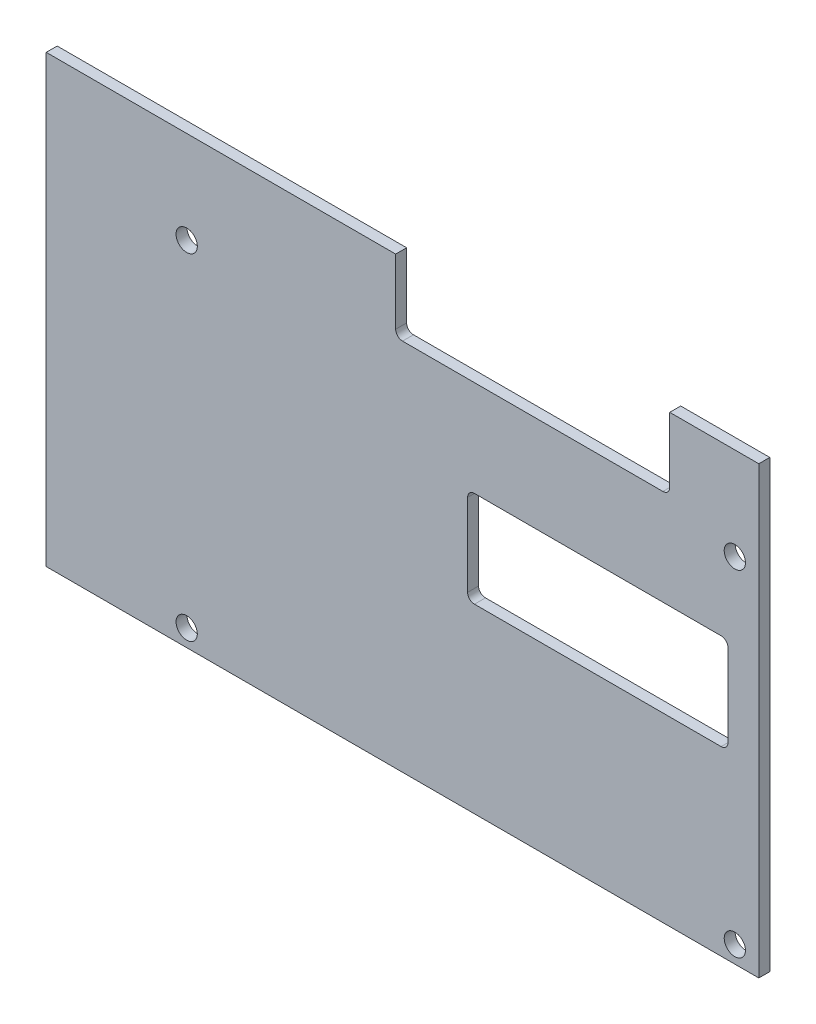
ISO-10303-21;
HEADER;
FILE_DESCRIPTION(('STEP AP214'),'2;1');
FILE_NAME('part.step','',(''),(''),'','','');
FILE_SCHEMA(('AUTOMOTIVE_DESIGN { 1 0 10303 214 1 1 1 1 }'));
ENDSEC;
DATA;
#1=APPLICATION_CONTEXT('core data for automotive mechanical design processes');
#2=APPLICATION_PROTOCOL_DEFINITION('international standard','automotive_design',2000,#1);
#3=PRODUCT_CONTEXT('',#1,'mechanical');
#4=PRODUCT('Part','Part','',(#3));
#5=PRODUCT_RELATED_PRODUCT_CATEGORY('part','',(#4));
#6=PRODUCT_DEFINITION_FORMATION('','',#4);
#7=PRODUCT_DEFINITION_CONTEXT('part definition',#1,'design');
#8=PRODUCT_DEFINITION('design','',#6,#7);
#9=PRODUCT_DEFINITION_SHAPE('','',#8);
#10=(LENGTH_UNIT() NAMED_UNIT(*) SI_UNIT(.MILLI.,.METRE.));
#11=(NAMED_UNIT(*) PLANE_ANGLE_UNIT() SI_UNIT($,.RADIAN.));
#12=(NAMED_UNIT(*) SI_UNIT($,.STERADIAN.) SOLID_ANGLE_UNIT());
#13=UNCERTAINTY_MEASURE_WITH_UNIT(LENGTH_MEASURE(1.E-05),#10,'distance_accuracy_value','');
#14=(GEOMETRIC_REPRESENTATION_CONTEXT(3) GLOBAL_UNCERTAINTY_ASSIGNED_CONTEXT((#13)) GLOBAL_UNIT_ASSIGNED_CONTEXT((#10,
#11,#12)) REPRESENTATION_CONTEXT('',''));
#15=CARTESIAN_POINT('',(0.,0.,0.));
#16=DIRECTION('',(0.,0.,1.));
#17=DIRECTION('',(1.,0.,0.));
#18=AXIS2_PLACEMENT_3D('',#15,#16,#17);
#19=CARTESIAN_POINT('',(52.,55.5,1.6));
#20=DIRECTION('',(0.,0.,-1.));
#21=DIRECTION('',(-1.,0.,0.));
#22=AXIS2_PLACEMENT_3D('',#19,#20,#21);
#23=PLANE('',#22);
#24=CARTESIAN_POINT('',(20.5,2.5,1.6));
#25=DIRECTION('',(0.,0.,1.));
#26=DIRECTION('',(1.,0.,0.));
#27=AXIS2_PLACEMENT_3D('',#24,#25,#26);
#28=CIRCLE('',#27,1.55);
#29=CARTESIAN_POINT('',(22.05,2.5,1.6));
#30=VERTEX_POINT('',#29);
#31=EDGE_CURVE('E221',#30,#30,#28,.T.);
#32=ORIENTED_EDGE('',*,*,#31,.F.);
#33=EDGE_LOOP('',(#32));
#34=FACE_BOUND('',#33,.T.);
#35=CARTESIAN_POINT('',(100.5,51.5,1.6));
#36=DIRECTION('',(0.,0.,1.));
#37=DIRECTION('',(1.,0.,0.));
#38=AXIS2_PLACEMENT_3D('',#35,#36,#37);
#39=CIRCLE('',#38,1.54999999999999);
#40=CARTESIAN_POINT('',(102.05,51.5,1.6));
#41=VERTEX_POINT('',#40);
#42=EDGE_CURVE('E233',#41,#41,#39,.T.);
#43=ORIENTED_EDGE('',*,*,#42,.F.);
#44=EDGE_LOOP('',(#43));
#45=FACE_BOUND('',#44,.T.);
#46=DIRECTION('',(0.,-1.,0.));
#47=VECTOR('',#46,1.);
#48=CARTESIAN_POINT('',(0.,0.,1.6));
#49=LINE('',#48,#47);
#50=CARTESIAN_POINT('',(0.,65.,1.6));
#51=VERTEX_POINT('',#50);
#52=CARTESIAN_POINT('',(0.,0.,1.6));
#53=VERTEX_POINT('',#52);
#54=EDGE_CURVE('E245',#51,#53,#49,.T.);
#55=ORIENTED_EDGE('',*,*,#54,.T.);
#56=DIRECTION('',(1.,0.,0.));
#57=VECTOR('',#56,1.);
#58=CARTESIAN_POINT('',(0.,0.,1.6));
#59=LINE('',#58,#57);
#60=CARTESIAN_POINT('',(104.,0.,1.6));
#61=VERTEX_POINT('',#60);
#62=EDGE_CURVE('E248',#53,#61,#59,.T.);
#63=ORIENTED_EDGE('',*,*,#62,.T.);
#64=DIRECTION('',(0.,1.,0.));
#65=VECTOR('',#64,1.);
#66=CARTESIAN_POINT('',(104.,0.,1.6));
#67=LINE('',#66,#65);
#68=CARTESIAN_POINT('',(104.,65.,1.6));
#69=VERTEX_POINT('',#68);
#70=EDGE_CURVE('E251',#61,#69,#67,.T.);
#71=ORIENTED_EDGE('',*,*,#70,.T.);
#72=DIRECTION('',(-1.,0.,0.));
#73=VECTOR('',#72,1.);
#74=CARTESIAN_POINT('',(91.,65.,1.6));
#75=LINE('',#74,#73);
#76=CARTESIAN_POINT('',(91.,65.,1.6));
#77=VERTEX_POINT('',#76);
#78=EDGE_CURVE('E253',#69,#77,#75,.T.);
#79=ORIENTED_EDGE('',*,*,#78,.T.);
#80=DIRECTION('',(0.,-1.,0.));
#81=VECTOR('',#80,1.);
#82=CARTESIAN_POINT('',(91.,55.5,1.6));
#83=LINE('',#82,#81);
#84=CARTESIAN_POINT('',(91.,55.5,1.6));
#85=VERTEX_POINT('',#84);
#86=EDGE_CURVE('E255',#77,#85,#83,.T.);
#87=ORIENTED_EDGE('',*,*,#86,.T.);
#88=CARTESIAN_POINT('',(90.,55.5,1.6));
#89=DIRECTION('',(0.,0.,-1.));
#90=DIRECTION('',(-1.,0.,0.));
#91=AXIS2_PLACEMENT_3D('',#88,#89,#90);
#92=CIRCLE('',#91,0.99999999999999);
#93=CARTESIAN_POINT('',(90.,54.5,1.6));
#94=VERTEX_POINT('',#93);
#95=EDGE_CURVE('E257',#85,#94,#92,.T.);
#96=ORIENTED_EDGE('',*,*,#95,.T.);
#97=DIRECTION('',(-1.,0.,0.));
#98=VECTOR('',#97,1.);
#99=CARTESIAN_POINT('',(52.,54.5,1.6));
#100=LINE('',#99,#98);
#101=CARTESIAN_POINT('',(52.,54.5,1.6));
#102=VERTEX_POINT('',#101);
#103=EDGE_CURVE('E259',#94,#102,#100,.T.);
#104=ORIENTED_EDGE('',*,*,#103,.T.);
#105=CARTESIAN_POINT('',(52.,55.5,1.6));
#106=DIRECTION('',(0.,0.,-1.));
#107=DIRECTION('',(-1.,0.,0.));
#108=AXIS2_PLACEMENT_3D('',#105,#106,#107);
#109=CIRCLE('',#108,1.);
#110=CARTESIAN_POINT('',(51.,55.5,1.6));
#111=VERTEX_POINT('',#110);
#112=EDGE_CURVE('E261',#102,#111,#109,.T.);
#113=ORIENTED_EDGE('',*,*,#112,.T.);
#114=DIRECTION('',(0.,1.,0.));
#115=VECTOR('',#114,1.);
#116=CARTESIAN_POINT('',(51.,65.,1.6));
#117=LINE('',#116,#115);
#118=CARTESIAN_POINT('',(51.,65.,1.6));
#119=VERTEX_POINT('',#118);
#120=EDGE_CURVE('E263',#111,#119,#117,.T.);
#121=ORIENTED_EDGE('',*,*,#120,.T.);
#122=DIRECTION('',(-1.,0.,0.));
#123=VECTOR('',#122,1.);
#124=CARTESIAN_POINT('',(0.,65.,1.6));
#125=LINE('',#124,#123);
#126=EDGE_CURVE('E265',#119,#51,#125,.T.);
#127=ORIENTED_EDGE('',*,*,#126,.T.);
#128=EDGE_LOOP('',(#55,#63,#71,#79,#87,#96,#104,#113,#121,#127));
#129=FACE_BOUND('',#128,.T.);
#130=CARTESIAN_POINT('',(20.5,51.5,1.6));
#131=DIRECTION('',(0.,0.,1.));
#132=DIRECTION('',(1.,0.,0.));
#133=AXIS2_PLACEMENT_3D('',#130,#131,#132);
#134=CIRCLE('',#133,1.55000000000001);
#135=CARTESIAN_POINT('',(22.05,51.5,1.6));
#136=VERTEX_POINT('',#135);
#137=EDGE_CURVE('E239',#136,#136,#134,.T.);
#138=ORIENTED_EDGE('',*,*,#137,.F.);
#139=EDGE_LOOP('',(#138));
#140=FACE_BOUND('',#139,.T.);
#141=CARTESIAN_POINT('',(100.5,2.5,1.6));
#142=DIRECTION('',(0.,0.,1.));
#143=DIRECTION('',(1.,0.,0.));
#144=AXIS2_PLACEMENT_3D('',#141,#142,#143);
#145=CIRCLE('',#144,1.54999999999999);
#146=CARTESIAN_POINT('',(102.05,2.5,1.6));
#147=VERTEX_POINT('',#146);
#148=EDGE_CURVE('E227',#147,#147,#145,.T.);
#149=ORIENTED_EDGE('',*,*,#148,.F.);
#150=EDGE_LOOP('',(#149));
#151=FACE_BOUND('',#150,.T.);
#152=CARTESIAN_POINT('',(62.5,39.5,1.6));
#153=DIRECTION('',(0.,0.,1.));
#154=DIRECTION('',(1.,0.,0.));
#155=AXIS2_PLACEMENT_3D('',#152,#153,#154);
#156=CIRCLE('',#155,0.999999999999997);
#157=CARTESIAN_POINT('',(62.5,40.5,1.6));
#158=VERTEX_POINT('',#157);
#159=CARTESIAN_POINT('',(61.5,39.5,1.6));
#160=VERTEX_POINT('',#159);
#161=EDGE_CURVE('E156',#158,#160,#156,.T.);
#162=ORIENTED_EDGE('',*,*,#161,.F.);
#163=DIRECTION('',(-1.,0.,0.));
#164=VECTOR('',#163,1.);
#165=CARTESIAN_POINT('',(62.5,40.5,1.6));
#166=LINE('',#165,#164);
#167=CARTESIAN_POINT('',(98.5,40.5,1.6));
#168=VERTEX_POINT('',#167);
#169=EDGE_CURVE('E189',#168,#158,#166,.T.);
#170=ORIENTED_EDGE('',*,*,#169,.F.);
#171=CARTESIAN_POINT('',(98.5,39.5,1.6));
#172=DIRECTION('',(0.,0.,1.));
#173=DIRECTION('',(1.,0.,0.));
#174=AXIS2_PLACEMENT_3D('',#171,#172,#173);
#175=CIRCLE('',#174,0.999999999999994);
#176=CARTESIAN_POINT('',(99.5,39.5,1.6));
#177=VERTEX_POINT('',#176);
#178=EDGE_CURVE('E187',#177,#168,#175,.T.);
#179=ORIENTED_EDGE('',*,*,#178,.F.);
#180=DIRECTION('',(0.,1.,0.));
#181=VECTOR('',#180,1.);
#182=CARTESIAN_POINT('',(99.5,39.5,1.6));
#183=LINE('',#182,#181);
#184=CARTESIAN_POINT('',(99.5,27.5,1.6));
#185=VERTEX_POINT('',#184);
#186=EDGE_CURVE('E185',#185,#177,#183,.T.);
#187=ORIENTED_EDGE('',*,*,#186,.F.);
#188=CARTESIAN_POINT('',(98.5,27.5,1.6));
#189=DIRECTION('',(0.,0.,1.));
#190=DIRECTION('',(-1.,0.,0.));
#191=AXIS2_PLACEMENT_3D('',#188,#189,#190);
#192=CIRCLE('',#191,0.999999999999994);
#193=CARTESIAN_POINT('',(98.5,26.5,1.6));
#194=VERTEX_POINT('',#193);
#195=EDGE_CURVE('E183',#194,#185,#192,.T.);
#196=ORIENTED_EDGE('',*,*,#195,.F.);
#197=DIRECTION('',(1.,0.,0.));
#198=VECTOR('',#197,1.);
#199=CARTESIAN_POINT('',(62.5,26.5,1.6));
#200=LINE('',#199,#198);
#201=CARTESIAN_POINT('',(62.5,26.5,1.6));
#202=VERTEX_POINT('',#201);
#203=EDGE_CURVE('E179',#202,#194,#200,.T.);
#204=ORIENTED_EDGE('',*,*,#203,.F.);
#205=CARTESIAN_POINT('',(62.5,27.5,1.6));
#206=DIRECTION('',(0.,0.,1.));
#207=DIRECTION('',(-1.,0.,0.));
#208=AXIS2_PLACEMENT_3D('',#205,#206,#207);
#209=CIRCLE('',#208,1.);
#210=CARTESIAN_POINT('',(61.5,27.5,1.6));
#211=VERTEX_POINT('',#210);
#212=EDGE_CURVE('E177',#211,#202,#209,.T.);
#213=ORIENTED_EDGE('',*,*,#212,.F.);
#214=DIRECTION('',(0.,-1.,0.));
#215=VECTOR('',#214,1.);
#216=CARTESIAN_POINT('',(61.5,39.5,1.6));
#217=LINE('',#216,#215);
#218=EDGE_CURVE('E164',#160,#211,#217,.T.);
#219=ORIENTED_EDGE('',*,*,#218,.F.);
#220=EDGE_LOOP('',(#162,#170,#179,#187,#196,#204,#213,#219));
#221=FACE_BOUND('',#220,.T.);
#222=ADVANCED_FACE('F31',(#34,#45,#129,#140,#151,#221),#23,.F.);
#223=CARTESIAN_POINT('',(52.,55.5,0.));
#224=DIRECTION('',(0.,0.,-1.));
#225=DIRECTION('',(-1.,0.,0.));
#226=AXIS2_PLACEMENT_3D('',#223,#224,#225);
#227=PLANE('',#226);
#228=CARTESIAN_POINT('',(20.5,2.5,0.));
#229=DIRECTION('',(0.,0.,1.));
#230=DIRECTION('',(1.,0.,0.));
#231=AXIS2_PLACEMENT_3D('',#228,#229,#230);
#232=CIRCLE('',#231,1.55);
#233=CARTESIAN_POINT('',(22.05,2.5,0.));
#234=VERTEX_POINT('',#233);
#235=EDGE_CURVE('E172',#234,#234,#232,.T.);
#236=ORIENTED_EDGE('',*,*,#235,.T.);
#237=EDGE_LOOP('',(#236));
#238=FACE_BOUND('',#237,.T.);
#239=CARTESIAN_POINT('',(100.5,51.5,0.));
#240=DIRECTION('',(0.,0.,1.));
#241=DIRECTION('',(1.,0.,0.));
#242=AXIS2_PLACEMENT_3D('',#239,#240,#241);
#243=CIRCLE('',#242,1.54999999999999);
#244=CARTESIAN_POINT('',(102.05,51.5,0.));
#245=VERTEX_POINT('',#244);
#246=EDGE_CURVE('E230',#245,#245,#243,.T.);
#247=ORIENTED_EDGE('',*,*,#246,.T.);
#248=EDGE_LOOP('',(#247));
#249=FACE_BOUND('',#248,.T.);
#250=DIRECTION('',(0.,-1.,0.));
#251=VECTOR('',#250,1.);
#252=CARTESIAN_POINT('',(0.,0.,0.));
#253=LINE('',#252,#251);
#254=CARTESIAN_POINT('',(0.,65.,0.));
#255=VERTEX_POINT('',#254);
#256=CARTESIAN_POINT('',(0.,0.,0.));
#257=VERTEX_POINT('',#256);
#258=EDGE_CURVE('E242',#255,#257,#253,.T.);
#259=ORIENTED_EDGE('',*,*,#258,.F.);
#260=DIRECTION('',(-1.,0.,0.));
#261=VECTOR('',#260,1.);
#262=CARTESIAN_POINT('',(0.,65.,0.));
#263=LINE('',#262,#261);
#264=CARTESIAN_POINT('',(51.,65.,0.));
#265=VERTEX_POINT('',#264);
#266=EDGE_CURVE('E249',#265,#255,#263,.T.);
#267=ORIENTED_EDGE('',*,*,#266,.F.);
#268=DIRECTION('',(0.,1.,0.));
#269=VECTOR('',#268,1.);
#270=CARTESIAN_POINT('',(51.,65.,0.));
#271=LINE('',#270,#269);
#272=CARTESIAN_POINT('',(51.,55.5,0.));
#273=VERTEX_POINT('',#272);
#274=EDGE_CURVE('E284',#273,#265,#271,.T.);
#275=ORIENTED_EDGE('',*,*,#274,.F.);
#276=CARTESIAN_POINT('',(52.,55.5,0.));
#277=DIRECTION('',(0.,0.,-1.));
#278=DIRECTION('',(-1.,0.,0.));
#279=AXIS2_PLACEMENT_3D('',#276,#277,#278);
#280=CIRCLE('',#279,1.);
#281=CARTESIAN_POINT('',(52.,54.5,0.));
#282=VERTEX_POINT('',#281);
#283=EDGE_CURVE('E282',#282,#273,#280,.T.);
#284=ORIENTED_EDGE('',*,*,#283,.F.);
#285=DIRECTION('',(-1.,0.,0.));
#286=VECTOR('',#285,1.);
#287=CARTESIAN_POINT('',(52.,54.5,0.));
#288=LINE('',#287,#286);
#289=CARTESIAN_POINT('',(90.,54.5,0.));
#290=VERTEX_POINT('',#289);
#291=EDGE_CURVE('E280',#290,#282,#288,.T.);
#292=ORIENTED_EDGE('',*,*,#291,.F.);
#293=CARTESIAN_POINT('',(90.,55.5,0.));
#294=DIRECTION('',(0.,0.,-1.));
#295=DIRECTION('',(-1.,0.,0.));
#296=AXIS2_PLACEMENT_3D('',#293,#294,#295);
#297=CIRCLE('',#296,0.99999999999999);
#298=CARTESIAN_POINT('',(91.,55.5,0.));
#299=VERTEX_POINT('',#298);
#300=EDGE_CURVE('E278',#299,#290,#297,.T.);
#301=ORIENTED_EDGE('',*,*,#300,.F.);
#302=DIRECTION('',(0.,-1.,0.));
#303=VECTOR('',#302,1.);
#304=CARTESIAN_POINT('',(91.,55.5,0.));
#305=LINE('',#304,#303);
#306=CARTESIAN_POINT('',(91.,65.,0.));
#307=VERTEX_POINT('',#306);
#308=EDGE_CURVE('E276',#307,#299,#305,.T.);
#309=ORIENTED_EDGE('',*,*,#308,.F.);
#310=DIRECTION('',(-1.,0.,0.));
#311=VECTOR('',#310,1.);
#312=CARTESIAN_POINT('',(91.,65.,0.));
#313=LINE('',#312,#311);
#314=CARTESIAN_POINT('',(104.,65.,0.));
#315=VERTEX_POINT('',#314);
#316=EDGE_CURVE('E274',#315,#307,#313,.T.);
#317=ORIENTED_EDGE('',*,*,#316,.F.);
#318=DIRECTION('',(0.,1.,0.));
#319=VECTOR('',#318,1.);
#320=CARTESIAN_POINT('',(104.,0.,0.));
#321=LINE('',#320,#319);
#322=CARTESIAN_POINT('',(104.,0.,0.));
#323=VERTEX_POINT('',#322);
#324=EDGE_CURVE('E272',#323,#315,#321,.T.);
#325=ORIENTED_EDGE('',*,*,#324,.F.);
#326=DIRECTION('',(1.,0.,0.));
#327=VECTOR('',#326,1.);
#328=CARTESIAN_POINT('',(0.,0.,0.));
#329=LINE('',#328,#327);
#330=EDGE_CURVE('E270',#257,#323,#329,.T.);
#331=ORIENTED_EDGE('',*,*,#330,.F.);
#332=EDGE_LOOP('',(#259,#267,#275,#284,#292,#301,#309,#317,#325,#331));
#333=FACE_BOUND('',#332,.T.);
#334=CARTESIAN_POINT('',(20.5,51.5,0.));
#335=DIRECTION('',(0.,0.,1.));
#336=DIRECTION('',(1.,0.,0.));
#337=AXIS2_PLACEMENT_3D('',#334,#335,#336);
#338=CIRCLE('',#337,1.55000000000001);
#339=CARTESIAN_POINT('',(22.05,51.5,0.));
#340=VERTEX_POINT('',#339);
#341=EDGE_CURVE('E236',#340,#340,#338,.T.);
#342=ORIENTED_EDGE('',*,*,#341,.T.);
#343=EDGE_LOOP('',(#342));
#344=FACE_BOUND('',#343,.T.);
#345=CARTESIAN_POINT('',(100.5,2.5,0.));
#346=DIRECTION('',(0.,0.,1.));
#347=DIRECTION('',(1.,0.,0.));
#348=AXIS2_PLACEMENT_3D('',#345,#346,#347);
#349=CIRCLE('',#348,1.54999999999999);
#350=CARTESIAN_POINT('',(102.05,2.5,0.));
#351=VERTEX_POINT('',#350);
#352=EDGE_CURVE('E224',#351,#351,#349,.T.);
#353=ORIENTED_EDGE('',*,*,#352,.T.);
#354=EDGE_LOOP('',(#353));
#355=FACE_BOUND('',#354,.T.);
#356=DIRECTION('',(-1.,0.,0.));
#357=VECTOR('',#356,1.);
#358=CARTESIAN_POINT('',(62.5,40.5,0.));
#359=LINE('',#358,#357);
#360=CARTESIAN_POINT('',(98.5,40.5,0.));
#361=VERTEX_POINT('',#360);
#362=CARTESIAN_POINT('',(62.5,40.5,0.));
#363=VERTEX_POINT('',#362);
#364=EDGE_CURVE('E165',#361,#363,#359,.T.);
#365=ORIENTED_EDGE('',*,*,#364,.T.);
#366=CARTESIAN_POINT('',(62.5,39.5,0.));
#367=DIRECTION('',(0.,0.,1.));
#368=DIRECTION('',(1.,0.,0.));
#369=AXIS2_PLACEMENT_3D('',#366,#367,#368);
#370=CIRCLE('',#369,0.999999999999997);
#371=CARTESIAN_POINT('',(61.5,39.5,0.));
#372=VERTEX_POINT('',#371);
#373=EDGE_CURVE('E54',#363,#372,#370,.T.);
#374=ORIENTED_EDGE('',*,*,#373,.T.);
#375=DIRECTION('',(0.,-1.,0.));
#376=VECTOR('',#375,1.);
#377=CARTESIAN_POINT('',(61.5,39.5,0.));
#378=LINE('',#377,#376);
#379=CARTESIAN_POINT('',(61.5,27.5,0.));
#380=VERTEX_POINT('',#379);
#381=EDGE_CURVE('E171',#372,#380,#378,.T.);
#382=ORIENTED_EDGE('',*,*,#381,.T.);
#383=CARTESIAN_POINT('',(62.5,27.5,0.));
#384=DIRECTION('',(0.,0.,1.));
#385=DIRECTION('',(-1.,0.,0.));
#386=AXIS2_PLACEMENT_3D('',#383,#384,#385);
#387=CIRCLE('',#386,1.);
#388=CARTESIAN_POINT('',(62.5,26.5,0.));
#389=VERTEX_POINT('',#388);
#390=EDGE_CURVE('E193',#380,#389,#387,.T.);
#391=ORIENTED_EDGE('',*,*,#390,.T.);
#392=DIRECTION('',(1.,0.,0.));
#393=VECTOR('',#392,1.);
#394=CARTESIAN_POINT('',(62.5,26.5,0.));
#395=LINE('',#394,#393);
#396=CARTESIAN_POINT('',(98.5,26.5,0.));
#397=VERTEX_POINT('',#396);
#398=EDGE_CURVE('E196',#389,#397,#395,.T.);
#399=ORIENTED_EDGE('',*,*,#398,.T.);
#400=CARTESIAN_POINT('',(98.5,27.5,0.));
#401=DIRECTION('',(0.,0.,1.));
#402=DIRECTION('',(-1.,0.,0.));
#403=AXIS2_PLACEMENT_3D('',#400,#401,#402);
#404=CIRCLE('',#403,0.999999999999994);
#405=CARTESIAN_POINT('',(99.5,27.5,0.));
#406=VERTEX_POINT('',#405);
#407=EDGE_CURVE('E199',#397,#406,#404,.T.);
#408=ORIENTED_EDGE('',*,*,#407,.T.);
#409=DIRECTION('',(0.,1.,0.));
#410=VECTOR('',#409,1.);
#411=CARTESIAN_POINT('',(99.5,39.5,0.));
#412=LINE('',#411,#410);
#413=CARTESIAN_POINT('',(99.5,39.5,0.));
#414=VERTEX_POINT('',#413);
#415=EDGE_CURVE('E202',#406,#414,#412,.T.);
#416=ORIENTED_EDGE('',*,*,#415,.T.);
#417=CARTESIAN_POINT('',(98.5,39.5,0.));
#418=DIRECTION('',(0.,0.,1.));
#419=DIRECTION('',(1.,0.,0.));
#420=AXIS2_PLACEMENT_3D('',#417,#418,#419);
#421=CIRCLE('',#420,0.999999999999994);
#422=EDGE_CURVE('E205',#414,#361,#421,.T.);
#423=ORIENTED_EDGE('',*,*,#422,.T.);
#424=EDGE_LOOP('',(#365,#374,#382,#391,#399,#408,#416,#423));
#425=FACE_BOUND('',#424,.T.);
#426=ADVANCED_FACE('F320',(#238,#249,#333,#344,#355,#425),#227,.T.);
#427=CARTESIAN_POINT('',(0.,0.,1.6));
#428=DIRECTION('',(1.,0.,0.));
#429=DIRECTION('',(0.,1.,0.));
#430=AXIS2_PLACEMENT_3D('',#427,#428,#429);
#431=PLANE('',#430);
#432=ORIENTED_EDGE('',*,*,#258,.T.);
#433=DIRECTION('',(0.,0.,-1.));
#434=VECTOR('',#433,1.);
#435=CARTESIAN_POINT('',(0.,0.,1.6));
#436=LINE('',#435,#434);
#437=EDGE_CURVE('E11',#53,#257,#436,.T.);
#438=ORIENTED_EDGE('',*,*,#437,.F.);
#439=ORIENTED_EDGE('',*,*,#54,.F.);
#440=DIRECTION('',(0.,0.,-1.));
#441=VECTOR('',#440,1.);
#442=CARTESIAN_POINT('',(0.,65.,1.6));
#443=LINE('',#442,#441);
#444=EDGE_CURVE('E267',#51,#255,#443,.T.);
#445=ORIENTED_EDGE('',*,*,#444,.T.);
#446=EDGE_LOOP('',(#432,#438,#439,#445));
#447=FACE_BOUND('',#446,.T.);
#448=ADVANCED_FACE('F33',(#447),#431,.F.);
#449=CARTESIAN_POINT('',(0.,0.,1.6));
#450=DIRECTION('',(0.,1.,0.));
#451=DIRECTION('',(0.,0.,1.));
#452=AXIS2_PLACEMENT_3D('',#449,#450,#451);
#453=PLANE('',#452);
#454=ORIENTED_EDGE('',*,*,#330,.T.);
#455=DIRECTION('',(0.,0.,-1.));
#456=VECTOR('',#455,1.);
#457=CARTESIAN_POINT('',(104.,0.,1.6));
#458=LINE('',#457,#456);
#459=EDGE_CURVE('E39',#61,#323,#458,.T.);
#460=ORIENTED_EDGE('',*,*,#459,.F.);
#461=ORIENTED_EDGE('',*,*,#62,.F.);
#462=ORIENTED_EDGE('',*,*,#437,.T.);
#463=EDGE_LOOP('',(#454,#460,#461,#462));
#464=FACE_BOUND('',#463,.T.);
#465=ADVANCED_FACE('F338',(#464),#453,.F.);
#466=CARTESIAN_POINT('',(104.,0.,1.6));
#467=DIRECTION('',(-1.,0.,0.));
#468=DIRECTION('',(0.,0.,1.));
#469=AXIS2_PLACEMENT_3D('',#466,#467,#468);
#470=PLANE('',#469);
#471=ORIENTED_EDGE('',*,*,#324,.T.);
#472=DIRECTION('',(0.,0.,-1.));
#473=VECTOR('',#472,1.);
#474=CARTESIAN_POINT('',(104.,65.,1.6));
#475=LINE('',#474,#473);
#476=EDGE_CURVE('E307',#69,#315,#475,.T.);
#477=ORIENTED_EDGE('',*,*,#476,.F.);
#478=ORIENTED_EDGE('',*,*,#70,.F.);
#479=ORIENTED_EDGE('',*,*,#459,.T.);
#480=EDGE_LOOP('',(#471,#477,#478,#479));
#481=FACE_BOUND('',#480,.T.);
#482=ADVANCED_FACE('F314',(#481),#470,.F.);
#483=CARTESIAN_POINT('',(91.,65.,1.6));
#484=DIRECTION('',(0.,-1.,0.));
#485=DIRECTION('',(0.,0.,-1.));
#486=AXIS2_PLACEMENT_3D('',#483,#484,#485);
#487=PLANE('',#486);
#488=ORIENTED_EDGE('',*,*,#316,.T.);
#489=DIRECTION('',(0.,0.,-1.));
#490=VECTOR('',#489,1.);
#491=CARTESIAN_POINT('',(91.,65.,1.6));
#492=LINE('',#491,#490);
#493=EDGE_CURVE('E304',#77,#307,#492,.T.);
#494=ORIENTED_EDGE('',*,*,#493,.F.);
#495=ORIENTED_EDGE('',*,*,#78,.F.);
#496=ORIENTED_EDGE('',*,*,#476,.T.);
#497=EDGE_LOOP('',(#488,#494,#495,#496));
#498=FACE_BOUND('',#497,.T.);
#499=ADVANCED_FACE('F326',(#498),#487,.F.);
#500=CARTESIAN_POINT('',(91.,55.5,1.6));
#501=DIRECTION('',(1.,0.,0.));
#502=DIRECTION('',(0.,1.,0.));
#503=AXIS2_PLACEMENT_3D('',#500,#501,#502);
#504=PLANE('',#503);
#505=ORIENTED_EDGE('',*,*,#308,.T.);
#506=DIRECTION('',(0.,0.,-1.));
#507=VECTOR('',#506,1.);
#508=CARTESIAN_POINT('',(91.,55.5,1.6));
#509=LINE('',#508,#507);
#510=EDGE_CURVE('E301',#85,#299,#509,.T.);
#511=ORIENTED_EDGE('',*,*,#510,.F.);
#512=ORIENTED_EDGE('',*,*,#86,.F.);
#513=ORIENTED_EDGE('',*,*,#493,.T.);
#514=EDGE_LOOP('',(#505,#511,#512,#513));
#515=FACE_BOUND('',#514,.T.);
#516=ADVANCED_FACE('F330',(#515),#504,.F.);
#517=CARTESIAN_POINT('',(90.,55.5,1.6));
#518=DIRECTION('',(0.,0.,-1.));
#519=DIRECTION('',(-1.,0.,0.));
#520=AXIS2_PLACEMENT_3D('',#517,#518,#519);
#521=CYLINDRICAL_SURFACE('',#520,0.99999999999999);
#522=ORIENTED_EDGE('',*,*,#300,.T.);
#523=DIRECTION('',(0.,0.,-1.));
#524=VECTOR('',#523,1.);
#525=CARTESIAN_POINT('',(90.,54.5,1.6));
#526=LINE('',#525,#524);
#527=EDGE_CURVE('E298',#94,#290,#526,.T.);
#528=ORIENTED_EDGE('',*,*,#527,.F.);
#529=ORIENTED_EDGE('',*,*,#95,.F.);
#530=ORIENTED_EDGE('',*,*,#510,.T.);
#531=EDGE_LOOP('',(#522,#528,#529,#530));
#532=FACE_BOUND('',#531,.T.);
#533=ADVANCED_FACE('F361',(#532),#521,.F.);
#534=CARTESIAN_POINT('',(52.,54.5,1.6));
#535=DIRECTION('',(0.,-1.,0.));
#536=DIRECTION('',(1.,0.,0.));
#537=AXIS2_PLACEMENT_3D('',#534,#535,#536);
#538=PLANE('',#537);
#539=ORIENTED_EDGE('',*,*,#291,.T.);
#540=DIRECTION('',(0.,0.,-1.));
#541=VECTOR('',#540,1.);
#542=CARTESIAN_POINT('',(52.,54.5,1.6));
#543=LINE('',#542,#541);
#544=EDGE_CURVE('E295',#102,#282,#543,.T.);
#545=ORIENTED_EDGE('',*,*,#544,.F.);
#546=ORIENTED_EDGE('',*,*,#103,.F.);
#547=ORIENTED_EDGE('',*,*,#527,.T.);
#548=EDGE_LOOP('',(#539,#545,#546,#547));
#549=FACE_BOUND('',#548,.T.);
#550=ADVANCED_FACE('F358',(#549),#538,.F.);
#551=CARTESIAN_POINT('',(52.,55.5,1.6));
#552=DIRECTION('',(0.,0.,-1.));
#553=DIRECTION('',(-1.,0.,0.));
#554=AXIS2_PLACEMENT_3D('',#551,#552,#553);
#555=CYLINDRICAL_SURFACE('',#554,1.);
#556=ORIENTED_EDGE('',*,*,#283,.T.);
#557=DIRECTION('',(0.,0.,-1.));
#558=VECTOR('',#557,1.);
#559=CARTESIAN_POINT('',(51.,55.5,1.6));
#560=LINE('',#559,#558);
#561=EDGE_CURVE('E292',#111,#273,#560,.T.);
#562=ORIENTED_EDGE('',*,*,#561,.F.);
#563=ORIENTED_EDGE('',*,*,#112,.F.);
#564=ORIENTED_EDGE('',*,*,#544,.T.);
#565=EDGE_LOOP('',(#556,#562,#563,#564));
#566=FACE_BOUND('',#565,.T.);
#567=ADVANCED_FACE('F354',(#566),#555,.F.);
#568=CARTESIAN_POINT('',(51.,65.,1.6));
#569=DIRECTION('',(-1.,0.,0.));
#570=DIRECTION('',(0.,0.,1.));
#571=AXIS2_PLACEMENT_3D('',#568,#569,#570);
#572=PLANE('',#571);
#573=ORIENTED_EDGE('',*,*,#274,.T.);
#574=DIRECTION('',(0.,0.,-1.));
#575=VECTOR('',#574,1.);
#576=CARTESIAN_POINT('',(51.,65.,1.6));
#577=LINE('',#576,#575);
#578=EDGE_CURVE('E289',#119,#265,#577,.T.);
#579=ORIENTED_EDGE('',*,*,#578,.F.);
#580=ORIENTED_EDGE('',*,*,#120,.F.);
#581=ORIENTED_EDGE('',*,*,#561,.T.);
#582=EDGE_LOOP('',(#573,#579,#580,#581));
#583=FACE_BOUND('',#582,.T.);
#584=ADVANCED_FACE('F350',(#583),#572,.F.);
#585=CARTESIAN_POINT('',(0.,65.,1.6));
#586=DIRECTION('',(0.,-1.,0.));
#587=DIRECTION('',(0.,0.,-1.));
#588=AXIS2_PLACEMENT_3D('',#585,#586,#587);
#589=PLANE('',#588);
#590=ORIENTED_EDGE('',*,*,#266,.T.);
#591=ORIENTED_EDGE('',*,*,#444,.F.);
#592=ORIENTED_EDGE('',*,*,#126,.F.);
#593=ORIENTED_EDGE('',*,*,#578,.T.);
#594=EDGE_LOOP('',(#590,#591,#592,#593));
#595=FACE_BOUND('',#594,.T.);
#596=ADVANCED_FACE('F345',(#595),#589,.F.);
#597=CARTESIAN_POINT('',(20.5,51.5,1.6));
#598=DIRECTION('',(0.,0.,-1.));
#599=DIRECTION('',(-1.,0.,0.));
#600=AXIS2_PLACEMENT_3D('',#597,#598,#599);
#601=CYLINDRICAL_SURFACE('',#600,1.55000000000001);
#602=ORIENTED_EDGE('',*,*,#137,.T.);
#603=EDGE_LOOP('',(#602));
#604=FACE_BOUND('',#603,.T.);
#605=ORIENTED_EDGE('',*,*,#341,.F.);
#606=EDGE_LOOP('',(#605));
#607=FACE_BOUND('',#606,.T.);
#608=ADVANCED_FACE('F381',(#604,#607),#601,.F.);
#609=CARTESIAN_POINT('',(100.5,51.5,1.6));
#610=DIRECTION('',(0.,0.,-1.));
#611=DIRECTION('',(-1.,0.,0.));
#612=AXIS2_PLACEMENT_3D('',#609,#610,#611);
#613=CYLINDRICAL_SURFACE('',#612,1.54999999999999);
#614=ORIENTED_EDGE('',*,*,#42,.T.);
#615=EDGE_LOOP('',(#614));
#616=FACE_BOUND('',#615,.T.);
#617=ORIENTED_EDGE('',*,*,#246,.F.);
#618=EDGE_LOOP('',(#617));
#619=FACE_BOUND('',#618,.T.);
#620=ADVANCED_FACE('F407',(#616,#619),#613,.F.);
#621=CARTESIAN_POINT('',(100.5,2.5,1.6));
#622=DIRECTION('',(0.,0.,-1.));
#623=DIRECTION('',(-1.,0.,0.));
#624=AXIS2_PLACEMENT_3D('',#621,#622,#623);
#625=CYLINDRICAL_SURFACE('',#624,1.54999999999999);
#626=ORIENTED_EDGE('',*,*,#148,.T.);
#627=EDGE_LOOP('',(#626));
#628=FACE_BOUND('',#627,.T.);
#629=ORIENTED_EDGE('',*,*,#352,.F.);
#630=EDGE_LOOP('',(#629));
#631=FACE_BOUND('',#630,.T.);
#632=ADVANCED_FACE('F414',(#628,#631),#625,.F.);
#633=CARTESIAN_POINT('',(20.5,2.5,1.6));
#634=DIRECTION('',(0.,0.,-1.));
#635=DIRECTION('',(-1.,0.,0.));
#636=AXIS2_PLACEMENT_3D('',#633,#634,#635);
#637=CYLINDRICAL_SURFACE('',#636,1.55);
#638=ORIENTED_EDGE('',*,*,#31,.T.);
#639=EDGE_LOOP('',(#638));
#640=FACE_BOUND('',#639,.T.);
#641=ORIENTED_EDGE('',*,*,#235,.F.);
#642=EDGE_LOOP('',(#641));
#643=FACE_BOUND('',#642,.T.);
#644=ADVANCED_FACE('F421',(#640,#643),#637,.F.);
#645=CARTESIAN_POINT('',(62.5,39.5,1.6));
#646=DIRECTION('',(0.,0.,-1.));
#647=DIRECTION('',(-1.,0.,0.));
#648=AXIS2_PLACEMENT_3D('',#645,#646,#647);
#649=CYLINDRICAL_SURFACE('',#648,0.999999999999997);
#650=ORIENTED_EDGE('',*,*,#373,.F.);
#651=DIRECTION('',(0.,0.,-1.));
#652=VECTOR('',#651,1.);
#653=CARTESIAN_POINT('',(62.5,40.5,1.6));
#654=LINE('',#653,#652);
#655=EDGE_CURVE('E160',#158,#363,#654,.T.);
#656=ORIENTED_EDGE('',*,*,#655,.F.);
#657=ORIENTED_EDGE('',*,*,#161,.T.);
#658=DIRECTION('',(0.,0.,-1.));
#659=VECTOR('',#658,1.);
#660=CARTESIAN_POINT('',(61.5,39.5,1.6));
#661=LINE('',#660,#659);
#662=EDGE_CURVE('E159',#160,#372,#661,.T.);
#663=ORIENTED_EDGE('',*,*,#662,.T.);
#664=EDGE_LOOP('',(#650,#656,#657,#663));
#665=FACE_BOUND('',#664,.T.);
#666=ADVANCED_FACE('F158',(#665),#649,.F.);
#667=CARTESIAN_POINT('',(61.5,39.5,1.6));
#668=DIRECTION('',(1.,0.,0.));
#669=DIRECTION('',(0.,1.,0.));
#670=AXIS2_PLACEMENT_3D('',#667,#668,#669);
#671=PLANE('',#670);
#672=ORIENTED_EDGE('',*,*,#381,.F.);
#673=ORIENTED_EDGE('',*,*,#662,.F.);
#674=ORIENTED_EDGE('',*,*,#218,.T.);
#675=DIRECTION('',(0.,0.,-1.));
#676=VECTOR('',#675,1.);
#677=CARTESIAN_POINT('',(61.5,27.5,1.6));
#678=LINE('',#677,#676);
#679=EDGE_CURVE('E173',#211,#380,#678,.T.);
#680=ORIENTED_EDGE('',*,*,#679,.T.);
#681=EDGE_LOOP('',(#672,#673,#674,#680));
#682=FACE_BOUND('',#681,.T.);
#683=ADVANCED_FACE('F168',(#682),#671,.T.);
#684=CARTESIAN_POINT('',(62.5,27.5,1.6));
#685=DIRECTION('',(0.,0.,-1.));
#686=DIRECTION('',(-1.,0.,0.));
#687=AXIS2_PLACEMENT_3D('',#684,#685,#686);
#688=CYLINDRICAL_SURFACE('',#687,1.);
#689=ORIENTED_EDGE('',*,*,#390,.F.);
#690=ORIENTED_EDGE('',*,*,#679,.F.);
#691=ORIENTED_EDGE('',*,*,#212,.T.);
#692=DIRECTION('',(0.,0.,-1.));
#693=VECTOR('',#692,1.);
#694=CARTESIAN_POINT('',(62.5,26.5,1.6));
#695=LINE('',#694,#693);
#696=EDGE_CURVE('E218',#202,#389,#695,.T.);
#697=ORIENTED_EDGE('',*,*,#696,.T.);
#698=EDGE_LOOP('',(#689,#690,#691,#697));
#699=FACE_BOUND('',#698,.T.);
#700=ADVANCED_FACE('F442',(#699),#688,.F.);
#701=CARTESIAN_POINT('',(62.5,26.5,1.6));
#702=DIRECTION('',(0.,1.,0.));
#703=DIRECTION('',(0.,0.,1.));
#704=AXIS2_PLACEMENT_3D('',#701,#702,#703);
#705=PLANE('',#704);
#706=ORIENTED_EDGE('',*,*,#398,.F.);
#707=ORIENTED_EDGE('',*,*,#696,.F.);
#708=ORIENTED_EDGE('',*,*,#203,.T.);
#709=DIRECTION('',(0.,0.,-1.));
#710=VECTOR('',#709,1.);
#711=CARTESIAN_POINT('',(98.5,26.5,1.6));
#712=LINE('',#711,#710);
#713=EDGE_CURVE('E216',#194,#397,#712,.T.);
#714=ORIENTED_EDGE('',*,*,#713,.T.);
#715=EDGE_LOOP('',(#706,#707,#708,#714));
#716=FACE_BOUND('',#715,.T.);
#717=ADVANCED_FACE('F449',(#716),#705,.T.);
#718=CARTESIAN_POINT('',(98.5,27.5,1.6));
#719=DIRECTION('',(0.,0.,-1.));
#720=DIRECTION('',(-1.,0.,0.));
#721=AXIS2_PLACEMENT_3D('',#718,#719,#720);
#722=CYLINDRICAL_SURFACE('',#721,0.999999999999994);
#723=ORIENTED_EDGE('',*,*,#407,.F.);
#724=ORIENTED_EDGE('',*,*,#713,.F.);
#725=ORIENTED_EDGE('',*,*,#195,.T.);
#726=DIRECTION('',(0.,0.,-1.));
#727=VECTOR('',#726,1.);
#728=CARTESIAN_POINT('',(99.5,27.5,1.6));
#729=LINE('',#728,#727);
#730=EDGE_CURVE('E214',#185,#406,#729,.T.);
#731=ORIENTED_EDGE('',*,*,#730,.T.);
#732=EDGE_LOOP('',(#723,#724,#725,#731));
#733=FACE_BOUND('',#732,.T.);
#734=ADVANCED_FACE('F457',(#733),#722,.F.);
#735=CARTESIAN_POINT('',(99.5,39.5,1.6));
#736=DIRECTION('',(-1.,0.,0.));
#737=DIRECTION('',(0.,0.,1.));
#738=AXIS2_PLACEMENT_3D('',#735,#736,#737);
#739=PLANE('',#738);
#740=ORIENTED_EDGE('',*,*,#415,.F.);
#741=ORIENTED_EDGE('',*,*,#730,.F.);
#742=ORIENTED_EDGE('',*,*,#186,.T.);
#743=DIRECTION('',(0.,0.,-1.));
#744=VECTOR('',#743,1.);
#745=CARTESIAN_POINT('',(99.5,39.5,1.6));
#746=LINE('',#745,#744);
#747=EDGE_CURVE('E212',#177,#414,#746,.T.);
#748=ORIENTED_EDGE('',*,*,#747,.T.);
#749=EDGE_LOOP('',(#740,#741,#742,#748));
#750=FACE_BOUND('',#749,.T.);
#751=ADVANCED_FACE('F465',(#750),#739,.T.);
#752=CARTESIAN_POINT('',(98.5,39.5,1.6));
#753=DIRECTION('',(0.,0.,-1.));
#754=DIRECTION('',(-1.,0.,0.));
#755=AXIS2_PLACEMENT_3D('',#752,#753,#754);
#756=CYLINDRICAL_SURFACE('',#755,0.999999999999994);
#757=ORIENTED_EDGE('',*,*,#422,.F.);
#758=ORIENTED_EDGE('',*,*,#747,.F.);
#759=ORIENTED_EDGE('',*,*,#178,.T.);
#760=DIRECTION('',(0.,0.,-1.));
#761=VECTOR('',#760,1.);
#762=CARTESIAN_POINT('',(98.5,40.5,1.6));
#763=LINE('',#762,#761);
#764=EDGE_CURVE('E46',#168,#361,#763,.T.);
#765=ORIENTED_EDGE('',*,*,#764,.T.);
#766=EDGE_LOOP('',(#757,#758,#759,#765));
#767=FACE_BOUND('',#766,.T.);
#768=ADVANCED_FACE('F473',(#767),#756,.F.);
#769=CARTESIAN_POINT('',(62.5,40.5,1.6));
#770=DIRECTION('',(0.,-1.,0.));
#771=DIRECTION('',(0.,0.,-1.));
#772=AXIS2_PLACEMENT_3D('',#769,#770,#771);
#773=PLANE('',#772);
#774=ORIENTED_EDGE('',*,*,#364,.F.);
#775=ORIENTED_EDGE('',*,*,#764,.F.);
#776=ORIENTED_EDGE('',*,*,#169,.T.);
#777=ORIENTED_EDGE('',*,*,#655,.T.);
#778=EDGE_LOOP('',(#774,#775,#776,#777));
#779=FACE_BOUND('',#778,.T.);
#780=ADVANCED_FACE('F481',(#779),#773,.T.);
#781=CLOSED_SHELL('',(#222,#426,#448,#465,#482,#499,#516,#533,#550,#567,#584,#596,#608,#620,
#632,#644,#666,#683,#700,#717,#734,#751,#768,#780));
#782=MANIFOLD_SOLID_BREP('B2',#781);
#783=ADVANCED_BREP_SHAPE_REPRESENTATION('',(#18,#782),#14);
#784=SHAPE_DEFINITION_REPRESENTATION(#9,#783);
ENDSEC;
END-ISO-10303-21;
